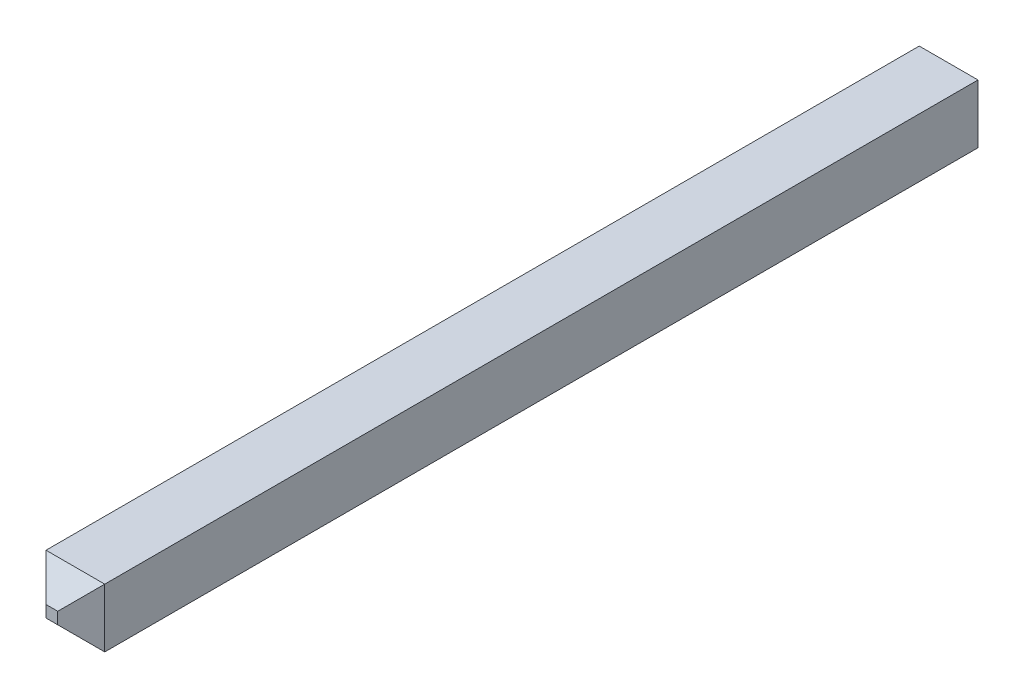
ISO-10303-21;
HEADER;
FILE_DESCRIPTION(('STEP AP214'),'2;1');
FILE_NAME('part.step','',(''),(''),'','','');
FILE_SCHEMA(('AUTOMOTIVE_DESIGN { 1 0 10303 214 1 1 1 1 }'));
ENDSEC;
DATA;
#1=APPLICATION_CONTEXT('core data for automotive mechanical design processes');
#2=APPLICATION_PROTOCOL_DEFINITION('international standard','automotive_design',2000,#1);
#3=PRODUCT_CONTEXT('',#1,'mechanical');
#4=PRODUCT('Part','Part','',(#3));
#5=PRODUCT_RELATED_PRODUCT_CATEGORY('part','',(#4));
#6=PRODUCT_DEFINITION_FORMATION('','',#4);
#7=PRODUCT_DEFINITION_CONTEXT('part definition',#1,'design');
#8=PRODUCT_DEFINITION('design','',#6,#7);
#9=PRODUCT_DEFINITION_SHAPE('','',#8);
#10=(LENGTH_UNIT() NAMED_UNIT(*) SI_UNIT(.MILLI.,.METRE.));
#11=(NAMED_UNIT(*) PLANE_ANGLE_UNIT() SI_UNIT($,.RADIAN.));
#12=(NAMED_UNIT(*) SI_UNIT($,.STERADIAN.) SOLID_ANGLE_UNIT());
#13=UNCERTAINTY_MEASURE_WITH_UNIT(LENGTH_MEASURE(1.E-05),#10,'distance_accuracy_value','');
#14=(GEOMETRIC_REPRESENTATION_CONTEXT(3) GLOBAL_UNCERTAINTY_ASSIGNED_CONTEXT((#13)) GLOBAL_UNIT_ASSIGNED_CONTEXT((#10,
#11,#12)) REPRESENTATION_CONTEXT('',''));
#15=CARTESIAN_POINT('',(0.,0.,0.));
#16=DIRECTION('',(0.,0.,1.));
#17=DIRECTION('',(1.,0.,0.));
#18=AXIS2_PLACEMENT_3D('',#15,#16,#17);
#19=CARTESIAN_POINT('',(0.931975872170931,-0.902265312346261,-0.0505976377952756));
#20=DIRECTION('',(0.,-0.707106781186552,0.707106781186543));
#21=DIRECTION('',(0.,-0.707106781186543,-0.707106781186552));
#22=AXIS2_PLACEMENT_3D('',#19,#20,#21);
#23=PLANE('',#22);
#24=DIRECTION('',(1.,0.,0.));
#25=VECTOR('',#24,1.);
#26=CARTESIAN_POINT('',(0.918983746186679,-0.914666887149411,-0.0629992125984253));
#27=LINE('',#26,#25);
#28=CARTESIAN_POINT('',(0.918688470596128,-0.914666887149411,-0.0629992125984252));
#29=VERTEX_POINT('',#28);
#30=CARTESIAN_POINT('',(0.912782958785104,-0.914666887149411,-0.0629992125984254));
#31=VERTEX_POINT('',#30);
#32=EDGE_CURVE('E111',#29,#31,#27,.F.);
#33=ORIENTED_EDGE('',*,*,#32,.T.);
#34=DIRECTION('',(0.577350269189608,-0.577350269189655,-0.577350269189614));
#35=VECTOR('',#34,1.);
#36=CARTESIAN_POINT('',(0.900971935163057,-0.902855863527363,-0.0511881889763778));
#37=LINE('',#36,#35);
#38=CARTESIAN_POINT('',(0.900971935163057,-0.902855863527363,-0.0511881889763779));
#39=VERTEX_POINT('',#38);
#40=EDGE_CURVE('E116',#39,#31,#37,.T.);
#41=ORIENTED_EDGE('',*,*,#40,.F.);
#42=DIRECTION('',(1.,0.,0.));
#43=VECTOR('',#42,1.);
#44=CARTESIAN_POINT('',(0.931975872170931,-0.902855863527363,-0.051188188976378));
#45=LINE('',#44,#43);
#46=CARTESIAN_POINT('',(0.930499494218175,-0.902855863527363,-0.0511881889763779));
#47=VERTEX_POINT('',#46);
#48=EDGE_CURVE('E120',#47,#39,#45,.F.);
#49=ORIENTED_EDGE('',*,*,#48,.F.);
#50=DIRECTION('',(0.57735026918961,0.577350269189652,0.577350269189615));
#51=VECTOR('',#50,1.);
#52=CARTESIAN_POINT('',(0.918688470596128,-0.914666887149411,-0.062999212598425));
#53=LINE('',#52,#51);
#54=EDGE_CURVE('E79',#29,#47,#53,.T.);
#55=ORIENTED_EDGE('',*,*,#54,.F.);
#56=EDGE_LOOP('',(#33,#41,#49,#55));
#57=FACE_BOUND('',#56,.T.);
#58=ADVANCED_FACE('F17',(#57),#23,.F.);
#59=CARTESIAN_POINT('',(0.899495557210301,-0.915257438330513,0.400189763779528));
#60=DIRECTION('',(0.,0.707106781186543,0.707106781186552));
#61=DIRECTION('',(0.,-0.707106781186552,0.707106781186543));
#62=AXIS2_PLACEMENT_3D('',#59,#60,#61);
#63=PLANE('',#62);
#64=DIRECTION('',(0.577350269189612,-0.577350269189659,0.577350269189606));
#65=VECTOR('',#64,1.);
#66=CARTESIAN_POINT('',(0.900971935163057,-0.902855863527363,0.387788188976378));
#67=LINE('',#66,#65);
#68=CARTESIAN_POINT('',(0.900971935163057,-0.902855863527363,0.387788188976378));
#69=VERTEX_POINT('',#68);
#70=CARTESIAN_POINT('',(0.912782958785104,-0.914666887149411,0.399599212598425));
#71=VERTEX_POINT('',#70);
#72=EDGE_CURVE('E90',#69,#71,#67,.T.);
#73=ORIENTED_EDGE('',*,*,#72,.T.);
#74=DIRECTION('',(1.,0.,0.));
#75=VECTOR('',#74,1.);
#76=CARTESIAN_POINT('',(0.918983746186679,-0.914666887149411,0.399599212598425));
#77=LINE('',#76,#75);
#78=CARTESIAN_POINT('',(0.918688470596128,-0.914666887149411,0.399599212598425));
#79=VERTEX_POINT('',#78);
#80=EDGE_CURVE('E20',#79,#71,#77,.F.);
#81=ORIENTED_EDGE('',*,*,#80,.F.);
#82=DIRECTION('',(0.577350269189611,0.577350269189658,-0.577350269189608));
#83=VECTOR('',#82,1.);
#84=CARTESIAN_POINT('',(0.918688470596129,-0.914666887149411,0.399599212598426));
#85=LINE('',#84,#83);
#86=CARTESIAN_POINT('',(0.930499494218175,-0.902855863527363,0.387788188976378));
#87=VERTEX_POINT('',#86);
#88=EDGE_CURVE('E88',#79,#87,#85,.T.);
#89=ORIENTED_EDGE('',*,*,#88,.T.);
#90=DIRECTION('',(1.,0.,0.));
#91=VECTOR('',#90,1.);
#92=CARTESIAN_POINT('',(0.931975872170931,-0.902855863527363,0.387788188976378));
#93=LINE('',#92,#91);
#94=EDGE_CURVE('E122',#69,#87,#93,.T.);
#95=ORIENTED_EDGE('',*,*,#94,.F.);
#96=EDGE_LOOP('',(#73,#81,#89,#95));
#97=FACE_BOUND('',#96,.T.);
#98=ADVANCED_FACE('F86',(#97),#63,.T.);
#99=CARTESIAN_POINT('',(0.918983746186679,-0.914371611558859,0.399599212598425));
#100=DIRECTION('',(0.,0.,1.));
#101=DIRECTION('',(0.,-1.,0.));
#102=AXIS2_PLACEMENT_3D('',#99,#100,#101);
#103=PLANE('',#102);
#104=DIRECTION('',(0.,1.,0.));
#105=VECTOR('',#104,1.);
#106=CARTESIAN_POINT('',(0.912782958785104,-0.901379485574607,0.399599212598425));
#107=LINE('',#106,#105);
#108=CARTESIAN_POINT('',(0.912782958785104,-0.920572398960434,0.399599212598425));
#109=VERTEX_POINT('',#108);
#110=EDGE_CURVE('E114',#71,#109,#107,.F.);
#111=ORIENTED_EDGE('',*,*,#110,.T.);
#112=DIRECTION('',(1.,0.,0.));
#113=VECTOR('',#112,1.);
#114=CARTESIAN_POINT('',(0.899495557210301,-0.920572398960435,0.399599212598426));
#115=LINE('',#114,#113);
#116=CARTESIAN_POINT('',(0.918688470596128,-0.920572398960434,0.399599212598425));
#117=VERTEX_POINT('',#116);
#118=EDGE_CURVE('E105',#109,#117,#115,.T.);
#119=ORIENTED_EDGE('',*,*,#118,.T.);
#120=DIRECTION('',(0.,1.,0.));
#121=VECTOR('',#120,1.);
#122=CARTESIAN_POINT('',(0.918688470596129,-0.933859800535237,0.399599212598426));
#123=LINE('',#122,#121);
#124=EDGE_CURVE('E94',#117,#79,#123,.T.);
#125=ORIENTED_EDGE('',*,*,#124,.T.);
#126=ORIENTED_EDGE('',*,*,#80,.T.);
#127=EDGE_LOOP('',(#111,#119,#125,#126));
#128=FACE_BOUND('',#127,.T.);
#129=ADVANCED_FACE('F103',(#128),#103,.T.);
#130=CARTESIAN_POINT('',(0.918097919415026,-0.933859800535237,0.400189763779528));
#131=DIRECTION('',(-0.707106781186544,0.,-0.707106781186551));
#132=DIRECTION('',(-0.707106781186551,0.,0.707106781186544));
#133=AXIS2_PLACEMENT_3D('',#130,#131,#132);
#134=PLANE('',#133);
#135=ORIENTED_EDGE('',*,*,#88,.F.);
#136=ORIENTED_EDGE('',*,*,#124,.F.);
#137=DIRECTION('',(0.577350269189627,-0.577350269189627,-0.577350269189624));
#138=VECTOR('',#137,1.);
#139=CARTESIAN_POINT('',(0.918688470596128,-0.920572398960435,0.399599212598426));
#140=LINE('',#139,#138);
#141=CARTESIAN_POINT('',(0.930499494218175,-0.932383422582481,0.387788188976378));
#142=VERTEX_POINT('',#141);
#143=EDGE_CURVE('E128',#117,#142,#140,.T.);
#144=ORIENTED_EDGE('',*,*,#143,.T.);
#145=DIRECTION('',(0.,-1.,0.));
#146=VECTOR('',#145,1.);
#147=CARTESIAN_POINT('',(0.930499494218175,-0.901379485574607,0.387788188976378));
#148=LINE('',#147,#146);
#149=EDGE_CURVE('E100',#142,#87,#148,.F.);
#150=ORIENTED_EDGE('',*,*,#149,.T.);
#151=EDGE_LOOP('',(#135,#136,#144,#150));
#152=FACE_BOUND('',#151,.T.);
#153=ADVANCED_FACE('F97',(#152),#134,.F.);
#154=CARTESIAN_POINT('',(0.931090045399277,-0.901379485574607,-0.0505976377952756));
#155=DIRECTION('',(0.707106781186552,0.,-0.707106781186543));
#156=DIRECTION('',(-0.707106781186543,0.,-0.707106781186552));
#157=AXIS2_PLACEMENT_3D('',#154,#155,#156);
#158=PLANE('',#157);
#159=DIRECTION('',(0.,-1.,0.));
#160=VECTOR('',#159,1.);
#161=CARTESIAN_POINT('',(0.930499494218175,-0.901379485574607,-0.051188188976378));
#162=LINE('',#161,#160);
#163=CARTESIAN_POINT('',(0.930499494218175,-0.932383422582481,-0.0511881889763779));
#164=VERTEX_POINT('',#163);
#165=EDGE_CURVE('E134',#47,#164,#162,.T.);
#166=ORIENTED_EDGE('',*,*,#165,.T.);
#167=DIRECTION('',(0.577350269189621,-0.577350269189626,0.577350269189631));
#168=VECTOR('',#167,1.);
#169=CARTESIAN_POINT('',(0.918688470596128,-0.920572398960434,-0.0629992125984256));
#170=LINE('',#169,#168);
#171=CARTESIAN_POINT('',(0.918688470596128,-0.920572398960434,-0.0629992125984252));
#172=VERTEX_POINT('',#171);
#173=EDGE_CURVE('E137',#172,#164,#170,.T.);
#174=ORIENTED_EDGE('',*,*,#173,.F.);
#175=DIRECTION('',(0.,-1.,0.));
#176=VECTOR('',#175,1.);
#177=CARTESIAN_POINT('',(0.918688470596128,-0.914371611558859,-0.0629992125984253));
#178=LINE('',#177,#176);
#179=EDGE_CURVE('E108',#172,#29,#178,.F.);
#180=ORIENTED_EDGE('',*,*,#179,.T.);
#181=ORIENTED_EDGE('',*,*,#54,.T.);
#182=EDGE_LOOP('',(#166,#174,#180,#181));
#183=FACE_BOUND('',#182,.T.);
#184=ADVANCED_FACE('F205',(#183),#158,.T.);
#185=CARTESIAN_POINT('',(0.918983746186679,-0.914371611558859,-0.0629992125984253));
#186=DIRECTION('',(0.,0.,1.));
#187=DIRECTION('',(0.,-1.,0.));
#188=AXIS2_PLACEMENT_3D('',#185,#186,#187);
#189=PLANE('',#188);
#190=ORIENTED_EDGE('',*,*,#32,.F.);
#191=ORIENTED_EDGE('',*,*,#179,.F.);
#192=DIRECTION('',(1.,0.,0.));
#193=VECTOR('',#192,1.);
#194=CARTESIAN_POINT('',(0.931975872170931,-0.920572398960434,-0.0629992125984256));
#195=LINE('',#194,#193);
#196=CARTESIAN_POINT('',(0.912782958785104,-0.920572398960434,-0.0629992125984252));
#197=VERTEX_POINT('',#196);
#198=EDGE_CURVE('E142',#197,#172,#195,.T.);
#199=ORIENTED_EDGE('',*,*,#198,.F.);
#200=DIRECTION('',(0.,1.,0.));
#201=VECTOR('',#200,1.);
#202=CARTESIAN_POINT('',(0.912782958785104,-0.933859800535237,-0.062999212598425));
#203=LINE('',#202,#201);
#204=EDGE_CURVE('E118',#31,#197,#203,.F.);
#205=ORIENTED_EDGE('',*,*,#204,.F.);
#206=EDGE_LOOP('',(#190,#191,#199,#205));
#207=FACE_BOUND('',#206,.T.);
#208=ADVANCED_FACE('F202',(#207),#189,.F.);
#209=CARTESIAN_POINT('',(0.913373509966207,-0.901379485574607,0.400189763779528));
#210=DIRECTION('',(0.707106781186544,0.,-0.707106781186551));
#211=DIRECTION('',(-0.707106781186551,0.,-0.707106781186544));
#212=AXIS2_PLACEMENT_3D('',#209,#210,#211);
#213=PLANE('',#212);
#214=ORIENTED_EDGE('',*,*,#72,.F.);
#215=DIRECTION('',(0.,1.,0.));
#216=VECTOR('',#215,1.);
#217=CARTESIAN_POINT('',(0.900971935163057,-0.933859800535237,0.387788188976378));
#218=LINE('',#217,#216);
#219=CARTESIAN_POINT('',(0.900971935163057,-0.932383422582481,0.387788188976378));
#220=VERTEX_POINT('',#219);
#221=EDGE_CURVE('E145',#69,#220,#218,.F.);
#222=ORIENTED_EDGE('',*,*,#221,.T.);
#223=DIRECTION('',(0.577350269189623,0.577350269189628,0.577350269189626));
#224=VECTOR('',#223,1.);
#225=CARTESIAN_POINT('',(0.900971935163057,-0.932383422582482,0.387788188976379));
#226=LINE('',#225,#224);
#227=EDGE_CURVE('E124',#220,#109,#226,.T.);
#228=ORIENTED_EDGE('',*,*,#227,.T.);
#229=ORIENTED_EDGE('',*,*,#110,.F.);
#230=EDGE_LOOP('',(#214,#222,#228,#229));
#231=FACE_BOUND('',#230,.T.);
#232=ADVANCED_FACE('F176',(#231),#213,.F.);
#233=CARTESIAN_POINT('',(0.900381383981955,-0.933859800535237,-0.0505976377952756));
#234=DIRECTION('',(-0.707106781186552,0.,-0.707106781186543));
#235=DIRECTION('',(-0.707106781186543,0.,0.707106781186552));
#236=AXIS2_PLACEMENT_3D('',#233,#234,#235);
#237=PLANE('',#236);
#238=ORIENTED_EDGE('',*,*,#204,.T.);
#239=DIRECTION('',(0.577350269189617,0.577350269189628,-0.577350269189633));
#240=VECTOR('',#239,1.);
#241=CARTESIAN_POINT('',(0.900971935163057,-0.932383422582481,-0.0511881889763783));
#242=LINE('',#241,#240);
#243=CARTESIAN_POINT('',(0.900971935163057,-0.932383422582481,-0.051188188976378));
#244=VERTEX_POINT('',#243);
#245=EDGE_CURVE('E139',#244,#197,#242,.T.);
#246=ORIENTED_EDGE('',*,*,#245,.F.);
#247=DIRECTION('',(0.,1.,0.));
#248=VECTOR('',#247,1.);
#249=CARTESIAN_POINT('',(0.900971935163057,-0.933859800535237,-0.051188188976378));
#250=LINE('',#249,#248);
#251=EDGE_CURVE('E34',#244,#39,#250,.T.);
#252=ORIENTED_EDGE('',*,*,#251,.T.);
#253=ORIENTED_EDGE('',*,*,#40,.T.);
#254=EDGE_LOOP('',(#238,#246,#252,#253));
#255=FACE_BOUND('',#254,.T.);
#256=ADVANCED_FACE('F195',(#255),#237,.T.);
#257=CARTESIAN_POINT('',(0.931975872170931,-0.902855863527363,0.152158267716535));
#258=DIRECTION('',(0.,1.,0.));
#259=DIRECTION('',(0.,0.,1.));
#260=AXIS2_PLACEMENT_3D('',#257,#258,#259);
#261=PLANE('',#260);
#262=DIRECTION('',(0.,0.,1.));
#263=VECTOR('',#262,1.);
#264=CARTESIAN_POINT('',(0.900971935163057,-0.902855863527363,0.152158267716535));
#265=LINE('',#264,#263);
#266=EDGE_CURVE('E149',#39,#69,#265,.T.);
#267=ORIENTED_EDGE('',*,*,#266,.T.);
#268=ORIENTED_EDGE('',*,*,#94,.T.);
#269=DIRECTION('',(0.,0.,1.));
#270=VECTOR('',#269,1.);
#271=CARTESIAN_POINT('',(0.930499494218175,-0.902855863527363,0.152158267716535));
#272=LINE('',#271,#270);
#273=EDGE_CURVE('E131',#87,#47,#272,.F.);
#274=ORIENTED_EDGE('',*,*,#273,.T.);
#275=ORIENTED_EDGE('',*,*,#48,.T.);
#276=EDGE_LOOP('',(#267,#268,#274,#275));
#277=FACE_BOUND('',#276,.T.);
#278=ADVANCED_FACE('F192',(#277),#261,.T.);
#279=CARTESIAN_POINT('',(0.899495557210301,-0.919981847779332,0.400189763779528));
#280=DIRECTION('',(0.,0.707106781186544,-0.707106781186551));
#281=DIRECTION('',(0.,0.707106781186551,0.707106781186544));
#282=AXIS2_PLACEMENT_3D('',#279,#280,#281);
#283=PLANE('',#282);
#284=ORIENTED_EDGE('',*,*,#118,.F.);
#285=ORIENTED_EDGE('',*,*,#227,.F.);
#286=DIRECTION('',(1.,0.,0.));
#287=VECTOR('',#286,1.);
#288=CARTESIAN_POINT('',(0.931975872170931,-0.932383422582481,0.387788188976378));
#289=LINE('',#288,#287);
#290=EDGE_CURVE('E152',#220,#142,#289,.T.);
#291=ORIENTED_EDGE('',*,*,#290,.T.);
#292=ORIENTED_EDGE('',*,*,#143,.F.);
#293=EDGE_LOOP('',(#284,#285,#291,#292));
#294=FACE_BOUND('',#293,.T.);
#295=ADVANCED_FACE('F173',(#294),#283,.F.);
#296=CARTESIAN_POINT('',(0.930499494218175,-0.901379485574607,0.152158267716535));
#297=DIRECTION('',(-1.,0.,0.));
#298=DIRECTION('',(0.,-1.,0.));
#299=AXIS2_PLACEMENT_3D('',#296,#297,#298);
#300=PLANE('',#299);
#301=ORIENTED_EDGE('',*,*,#165,.F.);
#302=ORIENTED_EDGE('',*,*,#273,.F.);
#303=ORIENTED_EDGE('',*,*,#149,.F.);
#304=DIRECTION('',(0.,0.,1.));
#305=VECTOR('',#304,1.);
#306=CARTESIAN_POINT('',(0.930499494218175,-0.932383422582481,0.152158267716535));
#307=LINE('',#306,#305);
#308=EDGE_CURVE('E155',#142,#164,#307,.F.);
#309=ORIENTED_EDGE('',*,*,#308,.T.);
#310=EDGE_LOOP('',(#301,#302,#303,#309));
#311=FACE_BOUND('',#310,.T.);
#312=ADVANCED_FACE('F171',(#311),#300,.F.);
#313=CARTESIAN_POINT('',(0.931975872170931,-0.932973973763584,-0.0505976377952756));
#314=DIRECTION('',(0.,-0.707106781186551,-0.707106781186544));
#315=DIRECTION('',(0.,0.707106781186544,-0.707106781186551));
#316=AXIS2_PLACEMENT_3D('',#313,#314,#315);
#317=PLANE('',#316);
#318=ORIENTED_EDGE('',*,*,#245,.T.);
#319=ORIENTED_EDGE('',*,*,#198,.T.);
#320=ORIENTED_EDGE('',*,*,#173,.T.);
#321=DIRECTION('',(1.,0.,0.));
#322=VECTOR('',#321,1.);
#323=CARTESIAN_POINT('',(0.931975872170931,-0.932383422582481,-0.051188188976378));
#324=LINE('',#323,#322);
#325=EDGE_CURVE('E26',#164,#244,#324,.F.);
#326=ORIENTED_EDGE('',*,*,#325,.T.);
#327=EDGE_LOOP('',(#318,#319,#320,#326));
#328=FACE_BOUND('',#327,.T.);
#329=ADVANCED_FACE('F161',(#328),#317,.T.);
#330=CARTESIAN_POINT('',(0.900971935163057,-0.933859800535237,0.152158267716535));
#331=DIRECTION('',(1.,0.,0.));
#332=DIRECTION('',(0.,1.,0.));
#333=AXIS2_PLACEMENT_3D('',#330,#331,#332);
#334=PLANE('',#333);
#335=ORIENTED_EDGE('',*,*,#251,.F.);
#336=DIRECTION('',(0.,0.,1.));
#337=VECTOR('',#336,1.);
#338=CARTESIAN_POINT('',(0.900971935163057,-0.932383422582481,0.152158267716535));
#339=LINE('',#338,#337);
#340=EDGE_CURVE('E11',#244,#220,#339,.T.);
#341=ORIENTED_EDGE('',*,*,#340,.T.);
#342=ORIENTED_EDGE('',*,*,#221,.F.);
#343=ORIENTED_EDGE('',*,*,#266,.F.);
#344=EDGE_LOOP('',(#335,#341,#342,#343));
#345=FACE_BOUND('',#344,.T.);
#346=ADVANCED_FACE('F177',(#345),#334,.F.);
#347=CARTESIAN_POINT('',(0.931975872170931,-0.932383422582481,0.152158267716535));
#348=DIRECTION('',(0.,1.,0.));
#349=DIRECTION('',(0.,0.,1.));
#350=AXIS2_PLACEMENT_3D('',#347,#348,#349);
#351=PLANE('',#350);
#352=ORIENTED_EDGE('',*,*,#325,.F.);
#353=ORIENTED_EDGE('',*,*,#308,.F.);
#354=ORIENTED_EDGE('',*,*,#290,.F.);
#355=ORIENTED_EDGE('',*,*,#340,.F.);
#356=EDGE_LOOP('',(#352,#353,#354,#355));
#357=FACE_BOUND('',#356,.T.);
#358=ADVANCED_FACE('F167',(#357),#351,.F.);
#359=CLOSED_SHELL('',(#58,#98,#129,#153,#184,#208,#232,#256,#278,#295,#312,#329,#346,#358));
#360=MANIFOLD_SOLID_BREP('B1',#359);
#361=ADVANCED_BREP_SHAPE_REPRESENTATION('',(#18,#360),#14);
#362=SHAPE_DEFINITION_REPRESENTATION(#9,#361);
ENDSEC;
END-ISO-10303-21;
